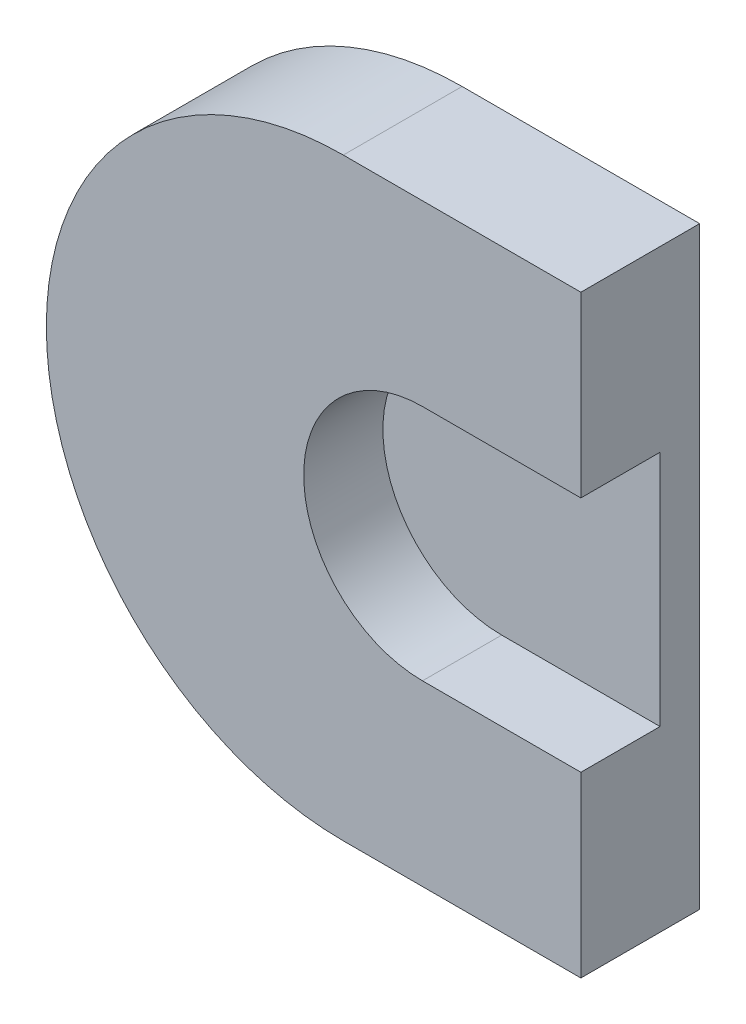
ISO-10303-21;
HEADER;
FILE_DESCRIPTION(('STEP AP214'),'2;1');
FILE_NAME('part.step','',(''),(''),'','','');
FILE_SCHEMA(('AUTOMOTIVE_DESIGN { 1 0 10303 214 1 1 1 1 }'));
ENDSEC;
DATA;
#1=APPLICATION_CONTEXT('core data for automotive mechanical design processes');
#2=APPLICATION_PROTOCOL_DEFINITION('international standard','automotive_design',2000,#1);
#3=PRODUCT_CONTEXT('',#1,'mechanical');
#4=PRODUCT('Part','Part','',(#3));
#5=PRODUCT_RELATED_PRODUCT_CATEGORY('part','',(#4));
#6=PRODUCT_DEFINITION_FORMATION('','',#4);
#7=PRODUCT_DEFINITION_CONTEXT('part definition',#1,'design');
#8=PRODUCT_DEFINITION('design','',#6,#7);
#9=PRODUCT_DEFINITION_SHAPE('','',#8);
#10=(LENGTH_UNIT() NAMED_UNIT(*) SI_UNIT(.MILLI.,.METRE.));
#11=(NAMED_UNIT(*) PLANE_ANGLE_UNIT() SI_UNIT($,.RADIAN.));
#12=(NAMED_UNIT(*) SI_UNIT($,.STERADIAN.) SOLID_ANGLE_UNIT());
#13=UNCERTAINTY_MEASURE_WITH_UNIT(LENGTH_MEASURE(1.E-05),#10,'distance_accuracy_value','');
#14=(GEOMETRIC_REPRESENTATION_CONTEXT(3) GLOBAL_UNCERTAINTY_ASSIGNED_CONTEXT((#13)) GLOBAL_UNIT_ASSIGNED_CONTEXT((#10,
#11,#12)) REPRESENTATION_CONTEXT('',''));
#15=CARTESIAN_POINT('',(0.,0.,0.));
#16=DIRECTION('',(0.,0.,1.));
#17=DIRECTION('',(1.,0.,0.));
#18=AXIS2_PLACEMENT_3D('',#15,#16,#17);
#19=CARTESIAN_POINT('',(0.,0.,3.));
#20=DIRECTION('',(0.,0.,-1.));
#21=DIRECTION('',(-1.,0.,0.));
#22=AXIS2_PLACEMENT_3D('',#19,#20,#21);
#23=CYLINDRICAL_SURFACE('',#22,7.5);
#24=CARTESIAN_POINT('',(0.,0.,0.));
#25=DIRECTION('',(0.,0.,1.));
#26=DIRECTION('',(1.,0.,0.));
#27=AXIS2_PLACEMENT_3D('',#24,#25,#26);
#28=CIRCLE('',#27,7.5);
#29=CARTESIAN_POINT('',(0.,7.5,0.));
#30=VERTEX_POINT('',#29);
#31=CARTESIAN_POINT('',(0.,-7.5,0.));
#32=VERTEX_POINT('',#31);
#33=EDGE_CURVE('E144',#30,#32,#28,.T.);
#34=ORIENTED_EDGE('',*,*,#33,.T.);
#35=DIRECTION('',(0.,0.,-1.));
#36=VECTOR('',#35,1.);
#37=CARTESIAN_POINT('',(0.,-7.5,3.));
#38=LINE('',#37,#36);
#39=CARTESIAN_POINT('',(0.,-7.5,3.));
#40=VERTEX_POINT('',#39);
#41=EDGE_CURVE('E44',#40,#32,#38,.T.);
#42=ORIENTED_EDGE('',*,*,#41,.F.);
#43=CARTESIAN_POINT('',(0.,0.,3.));
#44=DIRECTION('',(0.,0.,1.));
#45=DIRECTION('',(1.,0.,0.));
#46=AXIS2_PLACEMENT_3D('',#43,#44,#45);
#47=CIRCLE('',#46,7.5);
#48=CARTESIAN_POINT('',(0.,7.5,3.));
#49=VERTEX_POINT('',#48);
#50=EDGE_CURVE('E136',#49,#40,#47,.T.);
#51=ORIENTED_EDGE('',*,*,#50,.F.);
#52=DIRECTION('',(0.,0.,-1.));
#53=VECTOR('',#52,1.);
#54=CARTESIAN_POINT('',(0.,7.5,3.));
#55=LINE('',#54,#53);
#56=EDGE_CURVE('E143',#49,#30,#55,.T.);
#57=ORIENTED_EDGE('',*,*,#56,.T.);
#58=EDGE_LOOP('',(#34,#42,#51,#57));
#59=FACE_BOUND('',#58,.T.);
#60=ADVANCED_FACE('F37',(#59),#23,.T.);
#61=CARTESIAN_POINT('',(6.,-7.5,3.));
#62=DIRECTION('',(0.,1.,0.));
#63=DIRECTION('',(-1.,0.,0.));
#64=AXIS2_PLACEMENT_3D('',#61,#62,#63);
#65=PLANE('',#64);
#66=DIRECTION('',(1.,0.,0.));
#67=VECTOR('',#66,1.);
#68=CARTESIAN_POINT('',(6.,-7.5,0.));
#69=LINE('',#68,#67);
#70=CARTESIAN_POINT('',(6.,-7.5,0.));
#71=VERTEX_POINT('',#70);
#72=EDGE_CURVE('E147',#32,#71,#69,.T.);
#73=ORIENTED_EDGE('',*,*,#72,.T.);
#74=DIRECTION('',(0.,0.,-1.));
#75=VECTOR('',#74,1.);
#76=CARTESIAN_POINT('',(6.,-7.5,3.));
#77=LINE('',#76,#75);
#78=CARTESIAN_POINT('',(6.,-7.5,3.));
#79=VERTEX_POINT('',#78);
#80=EDGE_CURVE('E156',#79,#71,#77,.T.);
#81=ORIENTED_EDGE('',*,*,#80,.F.);
#82=DIRECTION('',(1.,0.,0.));
#83=VECTOR('',#82,1.);
#84=CARTESIAN_POINT('',(6.,-7.5,3.));
#85=LINE('',#84,#83);
#86=EDGE_CURVE('E89',#40,#79,#85,.T.);
#87=ORIENTED_EDGE('',*,*,#86,.F.);
#88=ORIENTED_EDGE('',*,*,#41,.T.);
#89=EDGE_LOOP('',(#73,#81,#87,#88));
#90=FACE_BOUND('',#89,.T.);
#91=ADVANCED_FACE('F159',(#90),#65,.F.);
#92=CARTESIAN_POINT('',(6.,7.5,3.));
#93=DIRECTION('',(-1.,0.,0.));
#94=DIRECTION('',(0.,0.,1.));
#95=AXIS2_PLACEMENT_3D('',#92,#93,#94);
#96=PLANE('',#95);
#97=DIRECTION('',(0.,1.,0.));
#98=VECTOR('',#97,1.);
#99=CARTESIAN_POINT('',(6.,7.5,1.));
#100=LINE('',#99,#98);
#101=CARTESIAN_POINT('',(6.,-3.,1.));
#102=VERTEX_POINT('',#101);
#103=CARTESIAN_POINT('',(6.,3.,1.));
#104=VERTEX_POINT('',#103);
#105=EDGE_CURVE('E11',#102,#104,#100,.T.);
#106=ORIENTED_EDGE('',*,*,#105,.F.);
#107=DIRECTION('',(0.,0.,1.));
#108=VECTOR('',#107,1.);
#109=CARTESIAN_POINT('',(6.,-3.,1.));
#110=LINE('',#109,#108);
#111=CARTESIAN_POINT('',(6.,-3.,3.));
#112=VERTEX_POINT('',#111);
#113=EDGE_CURVE('E148',#102,#112,#110,.T.);
#114=ORIENTED_EDGE('',*,*,#113,.T.);
#115=DIRECTION('',(0.,1.,0.));
#116=VECTOR('',#115,1.);
#117=CARTESIAN_POINT('',(6.,7.5,3.));
#118=LINE('',#117,#116);
#119=EDGE_CURVE('E139',#79,#112,#118,.T.);
#120=ORIENTED_EDGE('',*,*,#119,.F.);
#121=ORIENTED_EDGE('',*,*,#80,.T.);
#122=DIRECTION('',(0.,1.,0.));
#123=VECTOR('',#122,1.);
#124=CARTESIAN_POINT('',(6.,7.5,0.));
#125=LINE('',#124,#123);
#126=CARTESIAN_POINT('',(6.,7.5,0.));
#127=VERTEX_POINT('',#126);
#128=EDGE_CURVE('E150',#71,#127,#125,.T.);
#129=ORIENTED_EDGE('',*,*,#128,.T.);
#130=DIRECTION('',(0.,0.,-1.));
#131=VECTOR('',#130,1.);
#132=CARTESIAN_POINT('',(6.,7.5,3.));
#133=LINE('',#132,#131);
#134=CARTESIAN_POINT('',(6.,7.5,3.));
#135=VERTEX_POINT('',#134);
#136=EDGE_CURVE('E154',#135,#127,#133,.T.);
#137=ORIENTED_EDGE('',*,*,#136,.F.);
#138=CARTESIAN_POINT('',(6.,3.,3.));
#139=VERTEX_POINT('',#138);
#140=EDGE_CURVE('E129',#139,#135,#118,.T.);
#141=ORIENTED_EDGE('',*,*,#140,.F.);
#142=DIRECTION('',(0.,0.,1.));
#143=VECTOR('',#142,1.);
#144=CARTESIAN_POINT('',(6.,3.,1.));
#145=LINE('',#144,#143);
#146=EDGE_CURVE('E51',#104,#139,#145,.T.);
#147=ORIENTED_EDGE('',*,*,#146,.F.);
#148=EDGE_LOOP('',(#106,#114,#120,#121,#129,#137,#141,#147));
#149=FACE_BOUND('',#148,.T.);
#150=ADVANCED_FACE('F127',(#149),#96,.F.);
#151=CARTESIAN_POINT('',(0.,7.5,3.));
#152=DIRECTION('',(0.,-1.,0.));
#153=DIRECTION('',(1.,0.,0.));
#154=AXIS2_PLACEMENT_3D('',#151,#152,#153);
#155=PLANE('',#154);
#156=DIRECTION('',(-1.,0.,0.));
#157=VECTOR('',#156,1.);
#158=CARTESIAN_POINT('',(0.,7.5,0.));
#159=LINE('',#158,#157);
#160=EDGE_CURVE('E81',#127,#30,#159,.T.);
#161=ORIENTED_EDGE('',*,*,#160,.T.);
#162=ORIENTED_EDGE('',*,*,#56,.F.);
#163=DIRECTION('',(-1.,0.,0.));
#164=VECTOR('',#163,1.);
#165=CARTESIAN_POINT('',(0.,7.5,3.));
#166=LINE('',#165,#164);
#167=EDGE_CURVE('E60',#135,#49,#166,.T.);
#168=ORIENTED_EDGE('',*,*,#167,.F.);
#169=ORIENTED_EDGE('',*,*,#136,.T.);
#170=EDGE_LOOP('',(#161,#162,#168,#169));
#171=FACE_BOUND('',#170,.T.);
#172=ADVANCED_FACE('F167',(#171),#155,.F.);
#173=CARTESIAN_POINT('',(0.,0.,3.));
#174=DIRECTION('',(0.,0.,1.));
#175=DIRECTION('',(1.,0.,0.));
#176=AXIS2_PLACEMENT_3D('',#173,#174,#175);
#177=PLANE('',#176);
#178=DIRECTION('',(1.,0.,0.));
#179=VECTOR('',#178,1.);
#180=CARTESIAN_POINT('',(6.,-3.,3.));
#181=LINE('',#180,#179);
#182=CARTESIAN_POINT('',(2.,-3.,3.));
#183=VERTEX_POINT('',#182);
#184=EDGE_CURVE('E124',#183,#112,#181,.T.);
#185=ORIENTED_EDGE('',*,*,#184,.F.);
#186=CARTESIAN_POINT('',(2.,0.,3.));
#187=DIRECTION('',(0.,0.,1.));
#188=DIRECTION('',(1.,0.,0.));
#189=AXIS2_PLACEMENT_3D('',#186,#187,#188);
#190=CIRCLE('',#189,3.);
#191=CARTESIAN_POINT('',(2.,3.,3.));
#192=VERTEX_POINT('',#191);
#193=EDGE_CURVE('E174',#192,#183,#190,.T.);
#194=ORIENTED_EDGE('',*,*,#193,.F.);
#195=DIRECTION('',(-1.,0.,0.));
#196=VECTOR('',#195,1.);
#197=CARTESIAN_POINT('',(6.,3.,3.));
#198=LINE('',#197,#196);
#199=EDGE_CURVE('E177',#139,#192,#198,.T.);
#200=ORIENTED_EDGE('',*,*,#199,.F.);
#201=ORIENTED_EDGE('',*,*,#140,.T.);
#202=ORIENTED_EDGE('',*,*,#167,.T.);
#203=ORIENTED_EDGE('',*,*,#50,.T.);
#204=ORIENTED_EDGE('',*,*,#86,.T.);
#205=ORIENTED_EDGE('',*,*,#119,.T.);
#206=EDGE_LOOP('',(#185,#194,#200,#201,#202,#203,#204,#205));
#207=FACE_BOUND('',#206,.T.);
#208=ADVANCED_FACE('F169',(#207),#177,.T.);
#209=CARTESIAN_POINT('',(0.,0.,0.));
#210=DIRECTION('',(0.,0.,1.));
#211=DIRECTION('',(1.,0.,0.));
#212=AXIS2_PLACEMENT_3D('',#209,#210,#211);
#213=PLANE('',#212);
#214=ORIENTED_EDGE('',*,*,#33,.F.);
#215=ORIENTED_EDGE('',*,*,#160,.F.);
#216=ORIENTED_EDGE('',*,*,#128,.F.);
#217=ORIENTED_EDGE('',*,*,#72,.F.);
#218=EDGE_LOOP('',(#214,#215,#216,#217));
#219=FACE_BOUND('',#218,.T.);
#220=ADVANCED_FACE('F164',(#219),#213,.F.);
#221=CARTESIAN_POINT('',(6.,0.,1.));
#222=DIRECTION('',(0.,0.,1.));
#223=DIRECTION('',(1.,0.,0.));
#224=AXIS2_PLACEMENT_3D('',#221,#222,#223);
#225=PLANE('',#224);
#226=ORIENTED_EDGE('',*,*,#105,.T.);
#227=DIRECTION('',(-1.,0.,0.));
#228=VECTOR('',#227,1.);
#229=CARTESIAN_POINT('',(6.,3.,1.));
#230=LINE('',#229,#228);
#231=CARTESIAN_POINT('',(2.,3.,1.));
#232=VERTEX_POINT('',#231);
#233=EDGE_CURVE('E115',#104,#232,#230,.T.);
#234=ORIENTED_EDGE('',*,*,#233,.T.);
#235=CARTESIAN_POINT('',(2.,0.,1.));
#236=DIRECTION('',(0.,0.,1.));
#237=DIRECTION('',(1.,0.,0.));
#238=AXIS2_PLACEMENT_3D('',#235,#236,#237);
#239=CIRCLE('',#238,3.);
#240=CARTESIAN_POINT('',(2.,-3.,1.));
#241=VERTEX_POINT('',#240);
#242=EDGE_CURVE('E123',#232,#241,#239,.T.);
#243=ORIENTED_EDGE('',*,*,#242,.T.);
#244=DIRECTION('',(1.,0.,0.));
#245=VECTOR('',#244,1.);
#246=CARTESIAN_POINT('',(6.,-3.,1.));
#247=LINE('',#246,#245);
#248=EDGE_CURVE('E117',#241,#102,#247,.T.);
#249=ORIENTED_EDGE('',*,*,#248,.T.);
#250=EDGE_LOOP('',(#226,#234,#243,#249));
#251=FACE_BOUND('',#250,.T.);
#252=ADVANCED_FACE('F113',(#251),#225,.T.);
#253=CARTESIAN_POINT('',(6.,-3.,1.));
#254=DIRECTION('',(0.,-1.,0.));
#255=DIRECTION('',(0.,0.,-1.));
#256=AXIS2_PLACEMENT_3D('',#253,#254,#255);
#257=PLANE('',#256);
#258=ORIENTED_EDGE('',*,*,#184,.T.);
#259=ORIENTED_EDGE('',*,*,#113,.F.);
#260=ORIENTED_EDGE('',*,*,#248,.F.);
#261=DIRECTION('',(0.,0.,1.));
#262=VECTOR('',#261,1.);
#263=CARTESIAN_POINT('',(2.,-3.,1.));
#264=LINE('',#263,#262);
#265=EDGE_CURVE('E131',#241,#183,#264,.T.);
#266=ORIENTED_EDGE('',*,*,#265,.T.);
#267=EDGE_LOOP('',(#258,#259,#260,#266));
#268=FACE_BOUND('',#267,.T.);
#269=ADVANCED_FACE('F180',(#268),#257,.F.);
#270=CARTESIAN_POINT('',(2.,0.,1.));
#271=DIRECTION('',(0.,0.,1.));
#272=DIRECTION('',(1.,0.,0.));
#273=AXIS2_PLACEMENT_3D('',#270,#271,#272);
#274=CYLINDRICAL_SURFACE('',#273,3.);
#275=ORIENTED_EDGE('',*,*,#193,.T.);
#276=ORIENTED_EDGE('',*,*,#265,.F.);
#277=ORIENTED_EDGE('',*,*,#242,.F.);
#278=DIRECTION('',(0.,0.,1.));
#279=VECTOR('',#278,1.);
#280=CARTESIAN_POINT('',(2.,3.,1.));
#281=LINE('',#280,#279);
#282=EDGE_CURVE('E121',#232,#192,#281,.T.);
#283=ORIENTED_EDGE('',*,*,#282,.T.);
#284=EDGE_LOOP('',(#275,#276,#277,#283));
#285=FACE_BOUND('',#284,.T.);
#286=ADVANCED_FACE('F182',(#285),#274,.F.);
#287=CARTESIAN_POINT('',(6.,3.,1.));
#288=DIRECTION('',(0.,1.,0.));
#289=DIRECTION('',(-1.,0.,0.));
#290=AXIS2_PLACEMENT_3D('',#287,#288,#289);
#291=PLANE('',#290);
#292=ORIENTED_EDGE('',*,*,#199,.T.);
#293=ORIENTED_EDGE('',*,*,#282,.F.);
#294=ORIENTED_EDGE('',*,*,#233,.F.);
#295=ORIENTED_EDGE('',*,*,#146,.T.);
#296=EDGE_LOOP('',(#292,#293,#294,#295));
#297=FACE_BOUND('',#296,.T.);
#298=ADVANCED_FACE('F120',(#297),#291,.F.);
#299=CLOSED_SHELL('',(#60,#91,#150,#172,#208,#220,#252,#269,#286,#298));
#300=MANIFOLD_SOLID_BREP('B2',#299);
#301=ADVANCED_BREP_SHAPE_REPRESENTATION('',(#18,#300),#14);
#302=SHAPE_DEFINITION_REPRESENTATION(#9,#301);
ENDSEC;
END-ISO-10303-21;
